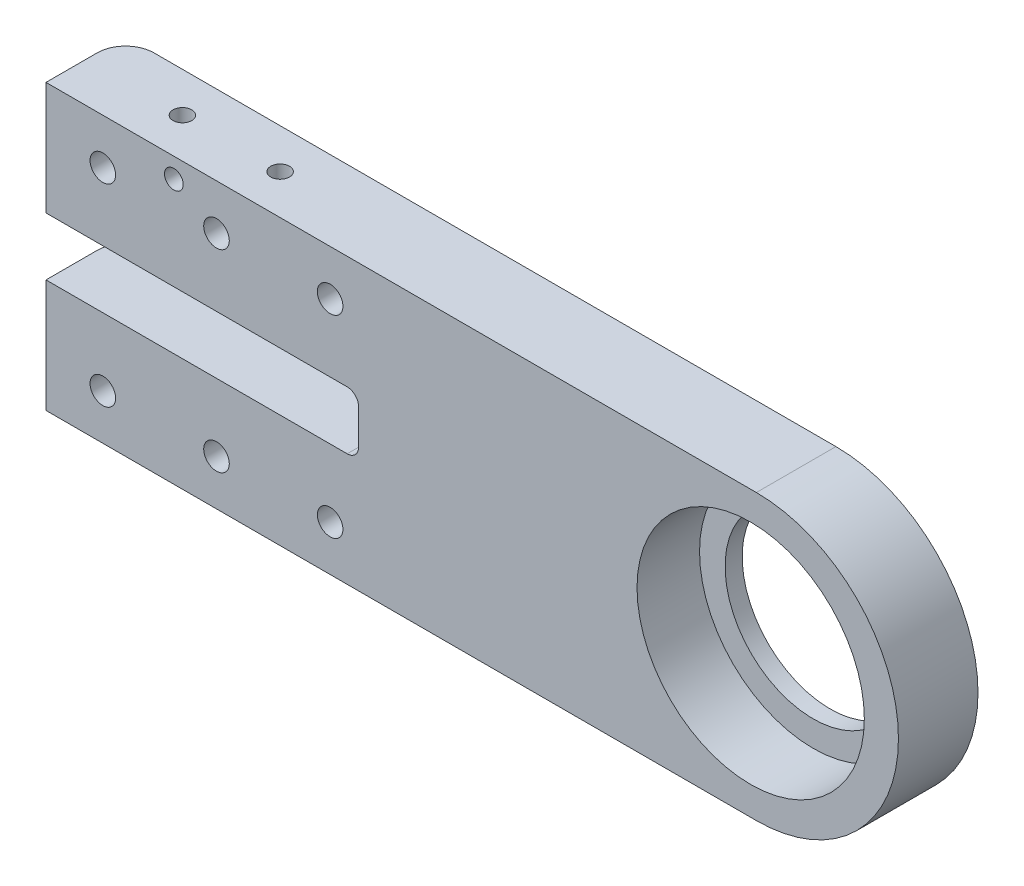
ISO-10303-21;
HEADER;
FILE_DESCRIPTION(('STEP AP214'),'2;1');
FILE_NAME('part.step','',(''),(''),'','','');
FILE_SCHEMA(('AUTOMOTIVE_DESIGN { 1 0 10303 214 1 1 1 1 }'));
ENDSEC;
DATA;
#1=APPLICATION_CONTEXT('core data for automotive mechanical design processes');
#2=APPLICATION_PROTOCOL_DEFINITION('international standard','automotive_design',2000,#1);
#3=PRODUCT_CONTEXT('',#1,'mechanical');
#4=PRODUCT('Part','Part','',(#3));
#5=PRODUCT_RELATED_PRODUCT_CATEGORY('part','',(#4));
#6=PRODUCT_DEFINITION_FORMATION('','',#4);
#7=PRODUCT_DEFINITION_CONTEXT('part definition',#1,'design');
#8=PRODUCT_DEFINITION('design','',#6,#7);
#9=PRODUCT_DEFINITION_SHAPE('','',#8);
#10=(LENGTH_UNIT() NAMED_UNIT(*) SI_UNIT(.MILLI.,.METRE.));
#11=(NAMED_UNIT(*) PLANE_ANGLE_UNIT() SI_UNIT($,.RADIAN.));
#12=(NAMED_UNIT(*) SI_UNIT($,.STERADIAN.) SOLID_ANGLE_UNIT());
#13=UNCERTAINTY_MEASURE_WITH_UNIT(LENGTH_MEASURE(1.E-05),#10,'distance_accuracy_value','');
#14=(GEOMETRIC_REPRESENTATION_CONTEXT(3) GLOBAL_UNCERTAINTY_ASSIGNED_CONTEXT((#13)) GLOBAL_UNIT_ASSIGNED_CONTEXT((#10,
#11,#12)) REPRESENTATION_CONTEXT('',''));
#15=CARTESIAN_POINT('',(0.,0.,0.));
#16=DIRECTION('',(0.,0.,1.));
#17=DIRECTION('',(1.,0.,0.));
#18=AXIS2_PLACEMENT_3D('',#15,#16,#17);
#19=CARTESIAN_POINT('',(0.,-50.,14.));
#20=DIRECTION('',(-1.,0.,0.));
#21=DIRECTION('',(0.,-1.,0.));
#22=AXIS2_PLACEMENT_3D('',#19,#20,#21);
#23=PLANE('',#22);
#24=DIRECTION('',(0.,0.,-1.));
#25=VECTOR('',#24,1.);
#26=CARTESIAN_POINT('',(0.,0.,14.));
#27=LINE('',#26,#25);
#28=CARTESIAN_POINT('',(0.,0.,14.));
#29=VERTEX_POINT('',#28);
#30=CARTESIAN_POINT('',(0.,0.,5.));
#31=VERTEX_POINT('',#30);
#32=EDGE_CURVE('E175',#29,#31,#27,.T.);
#33=ORIENTED_EDGE('',*,*,#32,.T.);
#34=DIRECTION('',(0.,1.,0.));
#35=VECTOR('',#34,1.);
#36=CARTESIAN_POINT('',(0.,-50.,5.));
#37=LINE('',#36,#35);
#38=CARTESIAN_POINT('',(0.,-19.8999999994651,5.));
#39=VERTEX_POINT('',#38);
#40=EDGE_CURVE('E43',#31,#39,#37,.F.);
#41=ORIENTED_EDGE('',*,*,#40,.T.);
#42=DIRECTION('',(0.,0.,1.));
#43=VECTOR('',#42,1.);
#44=CARTESIAN_POINT('',(0.,-19.8999999994651,0.));
#45=LINE('',#44,#43);
#46=CARTESIAN_POINT('',(0.,-19.8999999994651,14.));
#47=VERTEX_POINT('',#46);
#48=EDGE_CURVE('E134',#39,#47,#45,.T.);
#49=ORIENTED_EDGE('',*,*,#48,.T.);
#50=DIRECTION('',(0.,1.,0.));
#51=VECTOR('',#50,1.);
#52=CARTESIAN_POINT('',(0.,-50.,14.));
#53=LINE('',#52,#51);
#54=EDGE_CURVE('E153',#47,#29,#53,.T.);
#55=ORIENTED_EDGE('',*,*,#54,.T.);
#56=EDGE_LOOP('',(#33,#41,#49,#55));
#57=FACE_BOUND('',#56,.T.);
#58=ADVANCED_FACE('F35',(#57),#23,.T.);
#59=CARTESIAN_POINT('',(125.,-25.,14.));
#60=DIRECTION('',(0.,0.,-1.));
#61=DIRECTION('',(-1.,0.,0.));
#62=AXIS2_PLACEMENT_3D('',#59,#60,#61);
#63=CYLINDRICAL_SURFACE('',#62,25.);
#64=CARTESIAN_POINT('',(125.,-25.,0.));
#65=DIRECTION('',(0.,0.,-1.));
#66=DIRECTION('',(-1.,0.,0.));
#67=AXIS2_PLACEMENT_3D('',#64,#65,#66);
#68=CIRCLE('',#67,25.);
#69=CARTESIAN_POINT('',(125.,0.,0.));
#70=VERTEX_POINT('',#69);
#71=CARTESIAN_POINT('',(125.,-50.,0.));
#72=VERTEX_POINT('',#71);
#73=EDGE_CURVE('E162',#70,#72,#68,.T.);
#74=ORIENTED_EDGE('',*,*,#73,.F.);
#75=DIRECTION('',(0.,0.,-1.));
#76=VECTOR('',#75,1.);
#77=CARTESIAN_POINT('',(125.,0.,14.));
#78=LINE('',#77,#76);
#79=CARTESIAN_POINT('',(125.,0.,14.));
#80=VERTEX_POINT('',#79);
#81=EDGE_CURVE('E171',#80,#70,#78,.T.);
#82=ORIENTED_EDGE('',*,*,#81,.F.);
#83=CARTESIAN_POINT('',(125.,-25.,14.));
#84=DIRECTION('',(0.,0.,-1.));
#85=DIRECTION('',(-1.,0.,0.));
#86=AXIS2_PLACEMENT_3D('',#83,#84,#85);
#87=CIRCLE('',#86,25.);
#88=CARTESIAN_POINT('',(125.,-50.,14.));
#89=VERTEX_POINT('',#88);
#90=EDGE_CURVE('E170',#80,#89,#87,.T.);
#91=ORIENTED_EDGE('',*,*,#90,.T.);
#92=DIRECTION('',(0.,0.,-1.));
#93=VECTOR('',#92,1.);
#94=CARTESIAN_POINT('',(125.,-50.,14.));
#95=LINE('',#94,#93);
#96=EDGE_CURVE('E156',#89,#72,#95,.T.);
#97=ORIENTED_EDGE('',*,*,#96,.T.);
#98=EDGE_LOOP('',(#74,#82,#91,#97));
#99=FACE_BOUND('',#98,.T.);
#100=ADVANCED_FACE('F263',(#99),#63,.T.);
#101=CARTESIAN_POINT('',(0.,0.,14.));
#102=DIRECTION('',(0.,1.,0.));
#103=DIRECTION('',(0.,0.,1.));
#104=AXIS2_PLACEMENT_3D('',#101,#102,#103);
#105=PLANE('',#104);
#106=CARTESIAN_POINT('',(17.,0.,7.00000000000001));
#107=DIRECTION('',(0.,1.,0.));
#108=DIRECTION('',(0.,0.,1.));
#109=AXIS2_PLACEMENT_3D('',#106,#107,#108);
#110=CIRCLE('',#109,1.64999999999998);
#111=CARTESIAN_POINT('',(17.,0.,8.64999999999999));
#112=VERTEX_POINT('',#111);
#113=EDGE_CURVE('E370',#112,#112,#110,.T.);
#114=ORIENTED_EDGE('',*,*,#113,.F.);
#115=EDGE_LOOP('',(#114));
#116=FACE_BOUND('',#115,.T.);
#117=CARTESIAN_POINT('',(34.2,0.,7.00000000000001));
#118=DIRECTION('',(0.,1.,0.));
#119=DIRECTION('',(0.,0.,1.));
#120=AXIS2_PLACEMENT_3D('',#117,#118,#119);
#121=CIRCLE('',#120,1.64999999999998);
#122=CARTESIAN_POINT('',(34.2,0.,8.64999999999999));
#123=VERTEX_POINT('',#122);
#124=EDGE_CURVE('E376',#123,#123,#121,.T.);
#125=ORIENTED_EDGE('',*,*,#124,.F.);
#126=EDGE_LOOP('',(#125));
#127=FACE_BOUND('',#126,.T.);
#128=DIRECTION('',(1.,0.,0.));
#129=VECTOR('',#128,1.);
#130=CARTESIAN_POINT('',(0.,0.,0.));
#131=LINE('',#130,#129);
#132=CARTESIAN_POINT('',(5.,0.,0.));
#133=VERTEX_POINT('',#132);
#134=EDGE_CURVE('E168',#133,#70,#131,.T.);
#135=ORIENTED_EDGE('',*,*,#134,.F.);
#136=CARTESIAN_POINT('',(5.,0.,5.));
#137=DIRECTION('',(0.,1.,0.));
#138=DIRECTION('',(0.,0.,1.));
#139=AXIS2_PLACEMENT_3D('',#136,#137,#138);
#140=CIRCLE('',#139,5.);
#141=EDGE_CURVE('E57',#133,#31,#140,.T.);
#142=ORIENTED_EDGE('',*,*,#141,.T.);
#143=ORIENTED_EDGE('',*,*,#32,.F.);
#144=DIRECTION('',(1.,0.,0.));
#145=VECTOR('',#144,1.);
#146=CARTESIAN_POINT('',(0.,0.,14.));
#147=LINE('',#146,#145);
#148=EDGE_CURVE('E152',#29,#80,#147,.T.);
#149=ORIENTED_EDGE('',*,*,#148,.T.);
#150=ORIENTED_EDGE('',*,*,#81,.T.);
#151=EDGE_LOOP('',(#135,#142,#143,#149,#150));
#152=FACE_BOUND('',#151,.T.);
#153=ADVANCED_FACE('F268',(#116,#127,#152),#105,.T.);
#154=DIRECTION('',(0.,0.,1.));
#155=VECTOR('',#154,1.);
#156=CARTESIAN_POINT('',(0.,-30.0999999994651,0.));
#157=LINE('',#156,#155);
#158=CARTESIAN_POINT('',(0.,-30.0999999994651,5.));
#159=VERTEX_POINT('',#158);
#160=CARTESIAN_POINT('',(0.,-30.0999999994651,14.));
#161=VERTEX_POINT('',#160);
#162=EDGE_CURVE('E123',#159,#161,#157,.T.);
#163=ORIENTED_EDGE('',*,*,#162,.F.);
#164=DIRECTION('',(0.,1.,0.));
#165=VECTOR('',#164,1.);
#166=CARTESIAN_POINT('',(0.,-50.,5.));
#167=LINE('',#166,#165);
#168=CARTESIAN_POINT('',(0.,-50.,5.));
#169=VERTEX_POINT('',#168);
#170=EDGE_CURVE('E238',#159,#169,#167,.F.);
#171=ORIENTED_EDGE('',*,*,#170,.T.);
#172=DIRECTION('',(0.,0.,-1.));
#173=VECTOR('',#172,1.);
#174=CARTESIAN_POINT('',(0.,-50.,14.));
#175=LINE('',#174,#173);
#176=CARTESIAN_POINT('',(0.,-50.,14.));
#177=VERTEX_POINT('',#176);
#178=EDGE_CURVE('E151',#177,#169,#175,.T.);
#179=ORIENTED_EDGE('',*,*,#178,.F.);
#180=EDGE_CURVE('E142',#177,#161,#53,.T.);
#181=ORIENTED_EDGE('',*,*,#180,.T.);
#182=EDGE_LOOP('',(#163,#171,#179,#181));
#183=FACE_BOUND('',#182,.T.);
#184=ADVANCED_FACE('F149',(#183),#23,.T.);
#185=CARTESIAN_POINT('',(125.,-50.,14.));
#186=DIRECTION('',(0.,-1.,0.));
#187=DIRECTION('',(0.,0.,-1.));
#188=AXIS2_PLACEMENT_3D('',#185,#186,#187);
#189=PLANE('',#188);
#190=ORIENTED_EDGE('',*,*,#178,.T.);
#191=CARTESIAN_POINT('',(5.00000000000001,-50.,5.));
#192=DIRECTION('',(0.,-1.,0.));
#193=DIRECTION('',(0.,0.,-1.));
#194=AXIS2_PLACEMENT_3D('',#191,#192,#193);
#195=CIRCLE('',#194,5.);
#196=CARTESIAN_POINT('',(5.,-50.,0.));
#197=VERTEX_POINT('',#196);
#198=EDGE_CURVE('E240',#169,#197,#195,.T.);
#199=ORIENTED_EDGE('',*,*,#198,.T.);
#200=DIRECTION('',(-1.,0.,0.));
#201=VECTOR('',#200,1.);
#202=CARTESIAN_POINT('',(125.,-50.,0.));
#203=LINE('',#202,#201);
#204=EDGE_CURVE('E165',#72,#197,#203,.T.);
#205=ORIENTED_EDGE('',*,*,#204,.F.);
#206=ORIENTED_EDGE('',*,*,#96,.F.);
#207=DIRECTION('',(-1.,0.,0.));
#208=VECTOR('',#207,1.);
#209=CARTESIAN_POINT('',(125.,-50.,14.));
#210=LINE('',#209,#208);
#211=EDGE_CURVE('E158',#89,#177,#210,.T.);
#212=ORIENTED_EDGE('',*,*,#211,.T.);
#213=EDGE_LOOP('',(#190,#199,#205,#206,#212));
#214=FACE_BOUND('',#213,.T.);
#215=ADVANCED_FACE('F245',(#214),#189,.T.);
#216=CARTESIAN_POINT('',(125.,-25.,14.));
#217=DIRECTION('',(0.,0.,-1.));
#218=DIRECTION('',(-1.,0.,0.));
#219=AXIS2_PLACEMENT_3D('',#216,#217,#218);
#220=PLANE('',#219);
#221=CARTESIAN_POINT('',(123.999999994871,-24.9999999994651,14.));
#222=DIRECTION('',(0.,0.,1.));
#223=DIRECTION('',(1.,0.,0.));
#224=AXIS2_PLACEMENT_3D('',#221,#222,#223);
#225=CIRCLE('',#224,20.0000000051291);
#226=CARTESIAN_POINT('',(144.,-24.9999999994651,14.));
#227=VERTEX_POINT('',#226);
#228=EDGE_CURVE('E360',#227,#227,#225,.T.);
#229=ORIENTED_EDGE('',*,*,#228,.F.);
#230=EDGE_LOOP('',(#229));
#231=FACE_BOUND('',#230,.T.);
#232=CARTESIAN_POINT('',(22.5,-3.5,14.));
#233=DIRECTION('',(0.,0.,1.));
#234=DIRECTION('',(1.,0.,0.));
#235=AXIS2_PLACEMENT_3D('',#232,#233,#234);
#236=CIRCLE('',#235,1.64999999999998);
#237=CARTESIAN_POINT('',(24.15,-3.5,14.));
#238=VERTEX_POINT('',#237);
#239=EDGE_CURVE('E382',#238,#238,#236,.T.);
#240=ORIENTED_EDGE('',*,*,#239,.F.);
#241=EDGE_LOOP('',(#240));
#242=FACE_BOUND('',#241,.T.);
#243=CARTESIAN_POINT('',(10.,-8.,14.));
#244=DIRECTION('',(0.,0.,-1.));
#245=DIRECTION('',(-1.,0.,0.));
#246=AXIS2_PLACEMENT_3D('',#243,#244,#245);
#247=CIRCLE('',#246,2.24999999999997);
#248=CARTESIAN_POINT('',(7.75000000000003,-8.,14.));
#249=VERTEX_POINT('',#248);
#250=EDGE_CURVE('E388',#249,#249,#247,.T.);
#251=ORIENTED_EDGE('',*,*,#250,.T.);
#252=EDGE_LOOP('',(#251));
#253=FACE_BOUND('',#252,.T.);
#254=CARTESIAN_POINT('',(9.99999999999998,-42.,14.));
#255=DIRECTION('',(0.,0.,-1.));
#256=DIRECTION('',(-1.,0.,0.));
#257=AXIS2_PLACEMENT_3D('',#254,#255,#256);
#258=CIRCLE('',#257,2.24999999999997);
#259=CARTESIAN_POINT('',(7.75000000000002,-42.,14.));
#260=VERTEX_POINT('',#259);
#261=EDGE_CURVE('E391',#260,#260,#258,.T.);
#262=ORIENTED_EDGE('',*,*,#261,.T.);
#263=EDGE_LOOP('',(#262));
#264=FACE_BOUND('',#263,.T.);
#265=CARTESIAN_POINT('',(30.,-42.,14.));
#266=DIRECTION('',(0.,0.,-1.));
#267=DIRECTION('',(-1.,0.,0.));
#268=AXIS2_PLACEMENT_3D('',#265,#266,#267);
#269=CIRCLE('',#268,2.24999999999997);
#270=CARTESIAN_POINT('',(27.75,-42.,14.));
#271=VERTEX_POINT('',#270);
#272=EDGE_CURVE('E394',#271,#271,#269,.T.);
#273=ORIENTED_EDGE('',*,*,#272,.T.);
#274=EDGE_LOOP('',(#273));
#275=FACE_BOUND('',#274,.T.);
#276=CARTESIAN_POINT('',(30.,-8.,14.));
#277=DIRECTION('',(0.,0.,-1.));
#278=DIRECTION('',(-1.,0.,0.));
#279=AXIS2_PLACEMENT_3D('',#276,#277,#278);
#280=CIRCLE('',#279,2.24999999999996);
#281=CARTESIAN_POINT('',(27.75,-8.,14.));
#282=VERTEX_POINT('',#281);
#283=EDGE_CURVE('E397',#282,#282,#280,.T.);
#284=ORIENTED_EDGE('',*,*,#283,.T.);
#285=EDGE_LOOP('',(#284));
#286=FACE_BOUND('',#285,.T.);
#287=CARTESIAN_POINT('',(50.,-8.00000000000001,14.));
#288=DIRECTION('',(0.,0.,-1.));
#289=DIRECTION('',(-1.,0.,0.));
#290=AXIS2_PLACEMENT_3D('',#287,#288,#289);
#291=CIRCLE('',#290,2.24999999999997);
#292=CARTESIAN_POINT('',(47.75,-8.00000000000001,14.));
#293=VERTEX_POINT('',#292);
#294=EDGE_CURVE('E400',#293,#293,#291,.T.);
#295=ORIENTED_EDGE('',*,*,#294,.T.);
#296=EDGE_LOOP('',(#295));
#297=FACE_BOUND('',#296,.T.);
#298=CARTESIAN_POINT('',(50.,-42.,14.));
#299=DIRECTION('',(0.,0.,-1.));
#300=DIRECTION('',(-1.,0.,0.));
#301=AXIS2_PLACEMENT_3D('',#298,#299,#300);
#302=CIRCLE('',#301,2.24999999999997);
#303=CARTESIAN_POINT('',(47.75,-42.,14.));
#304=VERTEX_POINT('',#303);
#305=EDGE_CURVE('E147',#304,#304,#302,.T.);
#306=ORIENTED_EDGE('',*,*,#305,.T.);
#307=EDGE_LOOP('',(#306));
#308=FACE_BOUND('',#307,.T.);
#309=ORIENTED_EDGE('',*,*,#54,.F.);
#310=DIRECTION('',(-1.,0.,0.));
#311=VECTOR('',#310,1.);
#312=CARTESIAN_POINT('',(55.,-19.8999999994651,14.));
#313=LINE('',#312,#311);
#314=CARTESIAN_POINT('',(53.,-19.8999999994651,14.));
#315=VERTEX_POINT('',#314);
#316=EDGE_CURVE('E408',#315,#47,#313,.T.);
#317=ORIENTED_EDGE('',*,*,#316,.F.);
#318=CARTESIAN_POINT('',(53.,-21.8999999994651,14.));
#319=DIRECTION('',(0.,0.,-1.));
#320=DIRECTION('',(-1.,0.,0.));
#321=AXIS2_PLACEMENT_3D('',#318,#319,#320);
#322=CIRCLE('',#321,2.);
#323=CARTESIAN_POINT('',(55.,-21.8999999994651,14.));
#324=VERTEX_POINT('',#323);
#325=EDGE_CURVE('E224',#315,#324,#322,.T.);
#326=ORIENTED_EDGE('',*,*,#325,.T.);
#327=DIRECTION('',(0.,1.,0.));
#328=VECTOR('',#327,1.);
#329=CARTESIAN_POINT('',(55.,-30.0999999994651,14.));
#330=LINE('',#329,#328);
#331=CARTESIAN_POINT('',(55.,-28.0999999994651,14.));
#332=VERTEX_POINT('',#331);
#333=EDGE_CURVE('E146',#332,#324,#330,.T.);
#334=ORIENTED_EDGE('',*,*,#333,.F.);
#335=CARTESIAN_POINT('',(53.,-28.0999999994651,14.));
#336=DIRECTION('',(0.,0.,-1.));
#337=DIRECTION('',(-1.,0.,0.));
#338=AXIS2_PLACEMENT_3D('',#335,#336,#337);
#339=CIRCLE('',#338,2.);
#340=CARTESIAN_POINT('',(53.,-30.0999999994651,14.));
#341=VERTEX_POINT('',#340);
#342=EDGE_CURVE('E145',#332,#341,#339,.T.);
#343=ORIENTED_EDGE('',*,*,#342,.T.);
#344=DIRECTION('',(1.,0.,0.));
#345=VECTOR('',#344,1.);
#346=CARTESIAN_POINT('',(0.,-30.0999999994651,14.));
#347=LINE('',#346,#345);
#348=EDGE_CURVE('E128',#161,#341,#347,.T.);
#349=ORIENTED_EDGE('',*,*,#348,.F.);
#350=ORIENTED_EDGE('',*,*,#180,.F.);
#351=ORIENTED_EDGE('',*,*,#211,.F.);
#352=ORIENTED_EDGE('',*,*,#90,.F.);
#353=ORIENTED_EDGE('',*,*,#148,.F.);
#354=EDGE_LOOP('',(#309,#317,#326,#334,#343,#349,#350,#351,#352,#353));
#355=FACE_BOUND('',#354,.T.);
#356=ADVANCED_FACE('F140',(#231,#242,#253,#264,#275,#286,#297,#308,#355),#220,.F.);
#357=CARTESIAN_POINT('',(125.,-25.,0.));
#358=DIRECTION('',(0.,0.,-1.));
#359=DIRECTION('',(-1.,0.,0.));
#360=AXIS2_PLACEMENT_3D('',#357,#358,#359);
#361=PLANE('',#360);
#362=CARTESIAN_POINT('',(30.,-42.,0.));
#363=DIRECTION('',(0.,0.,-1.));
#364=DIRECTION('',(-1.,0.,0.));
#365=AXIS2_PLACEMENT_3D('',#362,#363,#364);
#366=CIRCLE('',#365,4.70000000001612);
#367=CARTESIAN_POINT('',(25.2999999999839,-42.,0.));
#368=VERTEX_POINT('',#367);
#369=EDGE_CURVE('E196',#368,#368,#366,.F.);
#370=ORIENTED_EDGE('',*,*,#369,.T.);
#371=EDGE_LOOP('',(#370));
#372=FACE_BOUND('',#371,.T.);
#373=CARTESIAN_POINT('',(9.99999999999998,-42.,0.));
#374=DIRECTION('',(0.,0.,-1.));
#375=DIRECTION('',(-1.,0.,0.));
#376=AXIS2_PLACEMENT_3D('',#373,#374,#375);
#377=CIRCLE('',#376,4.70000000001608);
#378=CARTESIAN_POINT('',(5.2999999999839,-42.,0.));
#379=VERTEX_POINT('',#378);
#380=EDGE_CURVE('E193',#379,#379,#377,.F.);
#381=ORIENTED_EDGE('',*,*,#380,.T.);
#382=EDGE_LOOP('',(#381));
#383=FACE_BOUND('',#382,.T.);
#384=CARTESIAN_POINT('',(50.,-42.,0.));
#385=DIRECTION('',(0.,0.,-1.));
#386=DIRECTION('',(-1.,0.,0.));
#387=AXIS2_PLACEMENT_3D('',#384,#385,#386);
#388=CIRCLE('',#387,4.70000000001608);
#389=CARTESIAN_POINT('',(45.2999999999839,-42.,0.));
#390=VERTEX_POINT('',#389);
#391=EDGE_CURVE('E190',#390,#390,#388,.F.);
#392=ORIENTED_EDGE('',*,*,#391,.T.);
#393=EDGE_LOOP('',(#392));
#394=FACE_BOUND('',#393,.T.);
#395=CARTESIAN_POINT('',(30.,-8.,0.));
#396=DIRECTION('',(0.,0.,-1.));
#397=DIRECTION('',(-1.,0.,0.));
#398=AXIS2_PLACEMENT_3D('',#395,#396,#397);
#399=CIRCLE('',#398,4.70000000001607);
#400=CARTESIAN_POINT('',(25.2999999999839,-8.,0.));
#401=VERTEX_POINT('',#400);
#402=EDGE_CURVE('E187',#401,#401,#399,.F.);
#403=ORIENTED_EDGE('',*,*,#402,.T.);
#404=EDGE_LOOP('',(#403));
#405=FACE_BOUND('',#404,.T.);
#406=CARTESIAN_POINT('',(10.,-8.,0.));
#407=DIRECTION('',(0.,0.,-1.));
#408=DIRECTION('',(-1.,0.,0.));
#409=AXIS2_PLACEMENT_3D('',#406,#407,#408);
#410=CIRCLE('',#409,4.70000000001612);
#411=CARTESIAN_POINT('',(5.29999999998388,-8.,0.));
#412=VERTEX_POINT('',#411);
#413=EDGE_CURVE('E184',#412,#412,#410,.F.);
#414=ORIENTED_EDGE('',*,*,#413,.T.);
#415=EDGE_LOOP('',(#414));
#416=FACE_BOUND('',#415,.T.);
#417=CARTESIAN_POINT('',(50.,-8.00000000000001,0.));
#418=DIRECTION('',(0.,0.,-1.));
#419=DIRECTION('',(-1.,0.,0.));
#420=AXIS2_PLACEMENT_3D('',#417,#418,#419);
#421=CIRCLE('',#420,4.70000000001608);
#422=CARTESIAN_POINT('',(45.2999999999839,-8.00000000000001,0.));
#423=VERTEX_POINT('',#422);
#424=EDGE_CURVE('E181',#423,#423,#421,.F.);
#425=ORIENTED_EDGE('',*,*,#424,.T.);
#426=EDGE_LOOP('',(#425));
#427=FACE_BOUND('',#426,.T.);
#428=CARTESIAN_POINT('',(123.999999994871,-24.9999999994651,0.));
#429=DIRECTION('',(0.,0.,1.));
#430=DIRECTION('',(1.,0.,0.));
#431=AXIS2_PLACEMENT_3D('',#428,#429,#430);
#432=CIRCLE('',#431,15.500000004746);
#433=CARTESIAN_POINT('',(139.499999999617,-24.9999999994651,0.));
#434=VERTEX_POINT('',#433);
#435=EDGE_CURVE('E367',#434,#434,#432,.T.);
#436=ORIENTED_EDGE('',*,*,#435,.T.);
#437=EDGE_LOOP('',(#436));
#438=FACE_BOUND('',#437,.T.);
#439=CARTESIAN_POINT('',(22.5,-3.5,0.));
#440=DIRECTION('',(0.,0.,1.));
#441=DIRECTION('',(1.,0.,0.));
#442=AXIS2_PLACEMENT_3D('',#439,#440,#441);
#443=CIRCLE('',#442,1.64999999999998);
#444=CARTESIAN_POINT('',(24.15,-3.5,0.));
#445=VERTEX_POINT('',#444);
#446=EDGE_CURVE('E385',#445,#445,#443,.T.);
#447=ORIENTED_EDGE('',*,*,#446,.T.);
#448=EDGE_LOOP('',(#447));
#449=FACE_BOUND('',#448,.T.);
#450=ORIENTED_EDGE('',*,*,#204,.T.);
#451=DIRECTION('',(0.,1.,0.));
#452=VECTOR('',#451,1.);
#453=CARTESIAN_POINT('',(5.,-25.,0.));
#454=LINE('',#453,#452);
#455=CARTESIAN_POINT('',(5.,-30.0999999994651,0.));
#456=VERTEX_POINT('',#455);
#457=EDGE_CURVE('E234',#197,#456,#454,.T.);
#458=ORIENTED_EDGE('',*,*,#457,.T.);
#459=DIRECTION('',(1.,0.,0.));
#460=VECTOR('',#459,1.);
#461=CARTESIAN_POINT('',(0.,-30.0999999994651,0.));
#462=LINE('',#461,#460);
#463=CARTESIAN_POINT('',(53.,-30.0999999994651,0.));
#464=VERTEX_POINT('',#463);
#465=EDGE_CURVE('E405',#456,#464,#462,.T.);
#466=ORIENTED_EDGE('',*,*,#465,.T.);
#467=CARTESIAN_POINT('',(53.,-28.0999999994651,0.));
#468=DIRECTION('',(0.,0.,-1.));
#469=DIRECTION('',(-1.,0.,0.));
#470=AXIS2_PLACEMENT_3D('',#467,#468,#469);
#471=CIRCLE('',#470,2.);
#472=CARTESIAN_POINT('',(55.,-28.0999999994651,0.));
#473=VERTEX_POINT('',#472);
#474=EDGE_CURVE('E229',#464,#473,#471,.F.);
#475=ORIENTED_EDGE('',*,*,#474,.T.);
#476=DIRECTION('',(0.,1.,0.));
#477=VECTOR('',#476,1.);
#478=CARTESIAN_POINT('',(55.,-30.0999999994651,0.));
#479=LINE('',#478,#477);
#480=CARTESIAN_POINT('',(55.,-21.8999999994651,0.));
#481=VERTEX_POINT('',#480);
#482=EDGE_CURVE('E407',#473,#481,#479,.T.);
#483=ORIENTED_EDGE('',*,*,#482,.T.);
#484=CARTESIAN_POINT('',(53.,-21.8999999994651,0.));
#485=DIRECTION('',(0.,0.,-1.));
#486=DIRECTION('',(-1.,0.,0.));
#487=AXIS2_PLACEMENT_3D('',#484,#485,#486);
#488=CIRCLE('',#487,2.);
#489=CARTESIAN_POINT('',(53.,-19.8999999994651,0.));
#490=VERTEX_POINT('',#489);
#491=EDGE_CURVE('E226',#481,#490,#488,.F.);
#492=ORIENTED_EDGE('',*,*,#491,.T.);
#493=DIRECTION('',(-1.,0.,0.));
#494=VECTOR('',#493,1.);
#495=CARTESIAN_POINT('',(55.,-19.8999999994651,0.));
#496=LINE('',#495,#494);
#497=CARTESIAN_POINT('',(5.,-19.8999999994651,0.));
#498=VERTEX_POINT('',#497);
#499=EDGE_CURVE('E135',#490,#498,#496,.T.);
#500=ORIENTED_EDGE('',*,*,#499,.T.);
#501=DIRECTION('',(0.,1.,0.));
#502=VECTOR('',#501,1.);
#503=CARTESIAN_POINT('',(5.,-25.,0.));
#504=LINE('',#503,#502);
#505=EDGE_CURVE('E231',#498,#133,#504,.T.);
#506=ORIENTED_EDGE('',*,*,#505,.T.);
#507=ORIENTED_EDGE('',*,*,#134,.T.);
#508=ORIENTED_EDGE('',*,*,#73,.T.);
#509=EDGE_LOOP('',(#450,#458,#466,#475,#483,#492,#500,#506,#507,#508));
#510=FACE_BOUND('',#509,.T.);
#511=ADVANCED_FACE('F249',(#372,#383,#394,#405,#416,#427,#438,#449,#510),#361,.T.);
#512=CARTESIAN_POINT('',(55.,-19.8999999994651,0.));
#513=DIRECTION('',(0.,1.,0.));
#514=DIRECTION('',(-1.,0.,0.));
#515=AXIS2_PLACEMENT_3D('',#512,#513,#514);
#516=PLANE('',#515);
#517=CARTESIAN_POINT('',(17.,-19.8999999994651,7.00000000000001));
#518=DIRECTION('',(0.,1.,0.));
#519=DIRECTION('',(-1.,0.,0.));
#520=AXIS2_PLACEMENT_3D('',#517,#518,#519);
#521=CIRCLE('',#520,1.64999999999998);
#522=CARTESIAN_POINT('',(15.35,-19.8999999994651,7.00000000000001));
#523=VERTEX_POINT('',#522);
#524=EDGE_CURVE('E373',#523,#523,#521,.T.);
#525=ORIENTED_EDGE('',*,*,#524,.T.);
#526=EDGE_LOOP('',(#525));
#527=FACE_BOUND('',#526,.T.);
#528=CARTESIAN_POINT('',(34.2,-19.8999999994651,7.00000000000001));
#529=DIRECTION('',(0.,1.,0.));
#530=DIRECTION('',(-1.,0.,0.));
#531=AXIS2_PLACEMENT_3D('',#528,#529,#530);
#532=CIRCLE('',#531,1.64999999999998);
#533=CARTESIAN_POINT('',(32.55,-19.8999999994651,7.00000000000001));
#534=VERTEX_POINT('',#533);
#535=EDGE_CURVE('E379',#534,#534,#532,.T.);
#536=ORIENTED_EDGE('',*,*,#535,.T.);
#537=EDGE_LOOP('',(#536));
#538=FACE_BOUND('',#537,.T.);
#539=ORIENTED_EDGE('',*,*,#48,.F.);
#540=CARTESIAN_POINT('',(5.,-19.8999999994651,5.));
#541=DIRECTION('',(0.,1.,0.));
#542=DIRECTION('',(-1.,0.,0.));
#543=AXIS2_PLACEMENT_3D('',#540,#541,#542);
#544=CIRCLE('',#543,5.);
#545=EDGE_CURVE('E11',#39,#498,#544,.F.);
#546=ORIENTED_EDGE('',*,*,#545,.T.);
#547=ORIENTED_EDGE('',*,*,#499,.F.);
#548=DIRECTION('',(0.,0.,1.));
#549=VECTOR('',#548,1.);
#550=CARTESIAN_POINT('',(53.,-19.8999999994651,14.));
#551=LINE('',#550,#549);
#552=EDGE_CURVE('E214',#490,#315,#551,.T.);
#553=ORIENTED_EDGE('',*,*,#552,.T.);
#554=ORIENTED_EDGE('',*,*,#316,.T.);
#555=EDGE_LOOP('',(#539,#546,#547,#553,#554));
#556=FACE_BOUND('',#555,.T.);
#557=ADVANCED_FACE('F286',(#527,#538,#556),#516,.F.);
#558=CARTESIAN_POINT('',(55.,-30.0999999994651,0.));
#559=DIRECTION('',(1.,0.,0.));
#560=DIRECTION('',(0.,0.,-1.));
#561=AXIS2_PLACEMENT_3D('',#558,#559,#560);
#562=PLANE('',#561);
#563=ORIENTED_EDGE('',*,*,#333,.T.);
#564=DIRECTION('',(0.,0.,1.));
#565=VECTOR('',#564,1.);
#566=CARTESIAN_POINT('',(55.,-21.8999999994651,0.));
#567=LINE('',#566,#565);
#568=EDGE_CURVE('E220',#324,#481,#567,.F.);
#569=ORIENTED_EDGE('',*,*,#568,.T.);
#570=ORIENTED_EDGE('',*,*,#482,.F.);
#571=DIRECTION('',(0.,0.,1.));
#572=VECTOR('',#571,1.);
#573=CARTESIAN_POINT('',(55.,-28.0999999994651,14.));
#574=LINE('',#573,#572);
#575=EDGE_CURVE('E217',#473,#332,#574,.T.);
#576=ORIENTED_EDGE('',*,*,#575,.T.);
#577=EDGE_LOOP('',(#563,#569,#570,#576));
#578=FACE_BOUND('',#577,.T.);
#579=ADVANCED_FACE('F294',(#578),#562,.F.);
#580=CARTESIAN_POINT('',(0.,-30.0999999994651,0.));
#581=DIRECTION('',(0.,-1.,0.));
#582=DIRECTION('',(0.,0.,-1.));
#583=AXIS2_PLACEMENT_3D('',#580,#581,#582);
#584=PLANE('',#583);
#585=ORIENTED_EDGE('',*,*,#465,.F.);
#586=CARTESIAN_POINT('',(5.,-30.0999999994651,5.));
#587=DIRECTION('',(0.,-1.,0.));
#588=DIRECTION('',(0.,0.,-1.));
#589=AXIS2_PLACEMENT_3D('',#586,#587,#588);
#590=CIRCLE('',#589,5.);
#591=EDGE_CURVE('E130',#456,#159,#590,.F.);
#592=ORIENTED_EDGE('',*,*,#591,.T.);
#593=ORIENTED_EDGE('',*,*,#162,.T.);
#594=ORIENTED_EDGE('',*,*,#348,.T.);
#595=DIRECTION('',(0.,0.,1.));
#596=VECTOR('',#595,1.);
#597=CARTESIAN_POINT('',(53.,-30.0999999994651,0.));
#598=LINE('',#597,#596);
#599=EDGE_CURVE('E222',#341,#464,#598,.F.);
#600=ORIENTED_EDGE('',*,*,#599,.T.);
#601=EDGE_LOOP('',(#585,#592,#593,#594,#600));
#602=FACE_BOUND('',#601,.T.);
#603=ADVANCED_FACE('F126',(#602),#584,.F.);
#604=CARTESIAN_POINT('',(50.,-42.,0.));
#605=DIRECTION('',(0.,0.,-1.));
#606=DIRECTION('',(-1.,0.,0.));
#607=AXIS2_PLACEMENT_3D('',#604,#605,#606);
#608=CYLINDRICAL_SURFACE('',#607,2.24999999999997);
#609=CARTESIAN_POINT('',(50.,-42.,2.4499999999024));
#610=DIRECTION('',(0.,0.,-1.));
#611=DIRECTION('',(-1.,0.,0.));
#612=AXIS2_PLACEMENT_3D('',#609,#610,#611);
#613=CIRCLE('',#612,2.24999999999997);
#614=CARTESIAN_POINT('',(47.75,-42.,2.4499999999024));
#615=VERTEX_POINT('',#614);
#616=EDGE_CURVE('E202',#615,#615,#613,.T.);
#617=ORIENTED_EDGE('',*,*,#616,.T.);
#618=EDGE_LOOP('',(#617));
#619=FACE_BOUND('',#618,.T.);
#620=ORIENTED_EDGE('',*,*,#305,.F.);
#621=EDGE_LOOP('',(#620));
#622=FACE_BOUND('',#621,.T.);
#623=ADVANCED_FACE('F293',(#619,#622),#608,.F.);
#624=CARTESIAN_POINT('',(50.,-8.00000000000001,0.));
#625=DIRECTION('',(0.,0.,-1.));
#626=DIRECTION('',(-1.,0.,0.));
#627=AXIS2_PLACEMENT_3D('',#624,#625,#626);
#628=CYLINDRICAL_SURFACE('',#627,2.24999999999997);
#629=CARTESIAN_POINT('',(50.,-8.00000000000001,2.4499999999024));
#630=DIRECTION('',(0.,0.,-1.));
#631=DIRECTION('',(-1.,0.,0.));
#632=AXIS2_PLACEMENT_3D('',#629,#630,#631);
#633=CIRCLE('',#632,2.24999999999997);
#634=CARTESIAN_POINT('',(47.75,-8.00000000000001,2.4499999999024));
#635=VERTEX_POINT('',#634);
#636=EDGE_CURVE('E211',#635,#635,#633,.T.);
#637=ORIENTED_EDGE('',*,*,#636,.T.);
#638=EDGE_LOOP('',(#637));
#639=FACE_BOUND('',#638,.T.);
#640=ORIENTED_EDGE('',*,*,#294,.F.);
#641=EDGE_LOOP('',(#640));
#642=FACE_BOUND('',#641,.T.);
#643=ADVANCED_FACE('F303',(#639,#642),#628,.F.);
#644=CARTESIAN_POINT('',(30.,-8.,0.));
#645=DIRECTION('',(0.,0.,-1.));
#646=DIRECTION('',(-1.,0.,0.));
#647=AXIS2_PLACEMENT_3D('',#644,#645,#646);
#648=CYLINDRICAL_SURFACE('',#647,2.24999999999996);
#649=CARTESIAN_POINT('',(30.,-8.,2.44999999990241));
#650=DIRECTION('',(0.,0.,-1.));
#651=DIRECTION('',(-1.,0.,0.));
#652=AXIS2_PLACEMENT_3D('',#649,#650,#651);
#653=CIRCLE('',#652,2.24999999999996);
#654=CARTESIAN_POINT('',(27.75,-8.,2.44999999990241));
#655=VERTEX_POINT('',#654);
#656=EDGE_CURVE('E205',#655,#655,#653,.T.);
#657=ORIENTED_EDGE('',*,*,#656,.T.);
#658=EDGE_LOOP('',(#657));
#659=FACE_BOUND('',#658,.T.);
#660=ORIENTED_EDGE('',*,*,#283,.F.);
#661=EDGE_LOOP('',(#660));
#662=FACE_BOUND('',#661,.T.);
#663=ADVANCED_FACE('F307',(#659,#662),#648,.F.);
#664=CARTESIAN_POINT('',(30.,-42.,0.));
#665=DIRECTION('',(0.,0.,-1.));
#666=DIRECTION('',(-1.,0.,0.));
#667=AXIS2_PLACEMENT_3D('',#664,#665,#666);
#668=CYLINDRICAL_SURFACE('',#667,2.24999999999997);
#669=CARTESIAN_POINT('',(30.,-42.,2.44999999990245));
#670=DIRECTION('',(0.,0.,-1.));
#671=DIRECTION('',(-1.,0.,0.));
#672=AXIS2_PLACEMENT_3D('',#669,#670,#671);
#673=CIRCLE('',#672,2.24999999999997);
#674=CARTESIAN_POINT('',(27.75,-42.,2.44999999990245));
#675=VERTEX_POINT('',#674);
#676=EDGE_CURVE('E174',#675,#675,#673,.T.);
#677=ORIENTED_EDGE('',*,*,#676,.T.);
#678=EDGE_LOOP('',(#677));
#679=FACE_BOUND('',#678,.T.);
#680=ORIENTED_EDGE('',*,*,#272,.F.);
#681=EDGE_LOOP('',(#680));
#682=FACE_BOUND('',#681,.T.);
#683=ADVANCED_FACE('F311',(#679,#682),#668,.F.);
#684=CARTESIAN_POINT('',(9.99999999999998,-42.,0.));
#685=DIRECTION('',(0.,0.,-1.));
#686=DIRECTION('',(-1.,0.,0.));
#687=AXIS2_PLACEMENT_3D('',#684,#685,#686);
#688=CYLINDRICAL_SURFACE('',#687,2.24999999999997);
#689=CARTESIAN_POINT('',(9.99999999999998,-42.,2.4499999999024));
#690=DIRECTION('',(0.,0.,-1.));
#691=DIRECTION('',(-1.,0.,0.));
#692=AXIS2_PLACEMENT_3D('',#689,#690,#691);
#693=CIRCLE('',#692,2.24999999999997);
#694=CARTESIAN_POINT('',(7.75000000000002,-42.,2.4499999999024));
#695=VERTEX_POINT('',#694);
#696=EDGE_CURVE('E199',#695,#695,#693,.T.);
#697=ORIENTED_EDGE('',*,*,#696,.T.);
#698=EDGE_LOOP('',(#697));
#699=FACE_BOUND('',#698,.T.);
#700=ORIENTED_EDGE('',*,*,#261,.F.);
#701=EDGE_LOOP('',(#700));
#702=FACE_BOUND('',#701,.T.);
#703=ADVANCED_FACE('F315',(#699,#702),#688,.F.);
#704=CARTESIAN_POINT('',(10.,-8.,0.));
#705=DIRECTION('',(0.,0.,-1.));
#706=DIRECTION('',(-1.,0.,0.));
#707=AXIS2_PLACEMENT_3D('',#704,#705,#706);
#708=CYLINDRICAL_SURFACE('',#707,2.24999999999997);
#709=CARTESIAN_POINT('',(10.,-8.,2.44999999990245));
#710=DIRECTION('',(0.,0.,-1.));
#711=DIRECTION('',(-1.,0.,0.));
#712=AXIS2_PLACEMENT_3D('',#709,#710,#711);
#713=CIRCLE('',#712,2.24999999999997);
#714=CARTESIAN_POINT('',(7.75000000000003,-8.,2.44999999990245));
#715=VERTEX_POINT('',#714);
#716=EDGE_CURVE('E208',#715,#715,#713,.T.);
#717=ORIENTED_EDGE('',*,*,#716,.T.);
#718=EDGE_LOOP('',(#717));
#719=FACE_BOUND('',#718,.T.);
#720=ORIENTED_EDGE('',*,*,#250,.F.);
#721=EDGE_LOOP('',(#720));
#722=FACE_BOUND('',#721,.T.);
#723=ADVANCED_FACE('F319',(#719,#722),#708,.F.);
#724=CARTESIAN_POINT('',(22.5,-3.5,14.));
#725=DIRECTION('',(0.,0.,1.));
#726=DIRECTION('',(1.,0.,0.));
#727=AXIS2_PLACEMENT_3D('',#724,#725,#726);
#728=CYLINDRICAL_SURFACE('',#727,1.64999999999998);
#729=ORIENTED_EDGE('',*,*,#446,.F.);
#730=EDGE_LOOP('',(#729));
#731=FACE_BOUND('',#730,.T.);
#732=ORIENTED_EDGE('',*,*,#239,.T.);
#733=EDGE_LOOP('',(#732));
#734=FACE_BOUND('',#733,.T.);
#735=ADVANCED_FACE('F323',(#731,#734),#728,.F.);
#736=CARTESIAN_POINT('',(34.2,0.,7.00000000000001));
#737=DIRECTION('',(0.,1.,0.));
#738=DIRECTION('',(0.,0.,1.));
#739=AXIS2_PLACEMENT_3D('',#736,#737,#738);
#740=CYLINDRICAL_SURFACE('',#739,1.64999999999998);
#741=ORIENTED_EDGE('',*,*,#535,.F.);
#742=EDGE_LOOP('',(#741));
#743=FACE_BOUND('',#742,.T.);
#744=ORIENTED_EDGE('',*,*,#124,.T.);
#745=EDGE_LOOP('',(#744));
#746=FACE_BOUND('',#745,.T.);
#747=ADVANCED_FACE('F327',(#743,#746),#740,.F.);
#748=CARTESIAN_POINT('',(17.,0.,7.00000000000001));
#749=DIRECTION('',(0.,1.,0.));
#750=DIRECTION('',(0.,0.,1.));
#751=AXIS2_PLACEMENT_3D('',#748,#749,#750);
#752=CYLINDRICAL_SURFACE('',#751,1.64999999999998);
#753=ORIENTED_EDGE('',*,*,#524,.F.);
#754=EDGE_LOOP('',(#753));
#755=FACE_BOUND('',#754,.T.);
#756=ORIENTED_EDGE('',*,*,#113,.T.);
#757=EDGE_LOOP('',(#756));
#758=FACE_BOUND('',#757,.T.);
#759=ADVANCED_FACE('F331',(#755,#758),#752,.F.);
#760=CARTESIAN_POINT('',(123.999999994871,-24.9999999994651,14.));
#761=DIRECTION('',(0.,0.,1.));
#762=DIRECTION('',(1.,0.,0.));
#763=AXIS2_PLACEMENT_3D('',#760,#761,#762);
#764=CYLINDRICAL_SURFACE('',#763,15.500000004746);
#765=ORIENTED_EDGE('',*,*,#435,.F.);
#766=EDGE_LOOP('',(#765));
#767=FACE_BOUND('',#766,.T.);
#768=CARTESIAN_POINT('',(123.999999994871,-24.9999999994651,3.));
#769=DIRECTION('',(0.,0.,1.));
#770=DIRECTION('',(1.,0.,0.));
#771=AXIS2_PLACEMENT_3D('',#768,#769,#770);
#772=CIRCLE('',#771,15.500000004746);
#773=CARTESIAN_POINT('',(139.499999999617,-24.9999999994651,3.));
#774=VERTEX_POINT('',#773);
#775=EDGE_CURVE('E362',#774,#774,#772,.T.);
#776=ORIENTED_EDGE('',*,*,#775,.T.);
#777=EDGE_LOOP('',(#776));
#778=FACE_BOUND('',#777,.T.);
#779=ADVANCED_FACE('F335',(#767,#778),#764,.F.);
#780=CARTESIAN_POINT('',(139.499999999617,-24.9999999994651,3.));
#781=DIRECTION('',(0.,0.,-1.));
#782=DIRECTION('',(-1.,0.,0.));
#783=AXIS2_PLACEMENT_3D('',#780,#781,#782);
#784=PLANE('',#783);
#785=ORIENTED_EDGE('',*,*,#775,.F.);
#786=EDGE_LOOP('',(#785));
#787=FACE_BOUND('',#786,.T.);
#788=CARTESIAN_POINT('',(123.999999994871,-24.9999999994651,3.));
#789=DIRECTION('',(0.,0.,1.));
#790=DIRECTION('',(1.,0.,0.));
#791=AXIS2_PLACEMENT_3D('',#788,#789,#790);
#792=CIRCLE('',#791,20.0000000051291);
#793=CARTESIAN_POINT('',(144.,-24.9999999994651,3.));
#794=VERTEX_POINT('',#793);
#795=EDGE_CURVE('E357',#794,#794,#792,.T.);
#796=ORIENTED_EDGE('',*,*,#795,.T.);
#797=EDGE_LOOP('',(#796));
#798=FACE_BOUND('',#797,.T.);
#799=ADVANCED_FACE('F339',(#787,#798),#784,.F.);
#800=CARTESIAN_POINT('',(123.999999994871,-24.9999999994651,14.));
#801=DIRECTION('',(0.,0.,1.));
#802=DIRECTION('',(1.,0.,0.));
#803=AXIS2_PLACEMENT_3D('',#800,#801,#802);
#804=CYLINDRICAL_SURFACE('',#803,20.0000000051291);
#805=ORIENTED_EDGE('',*,*,#795,.F.);
#806=EDGE_LOOP('',(#805));
#807=FACE_BOUND('',#806,.T.);
#808=ORIENTED_EDGE('',*,*,#228,.T.);
#809=EDGE_LOOP('',(#808));
#810=FACE_BOUND('',#809,.T.);
#811=ADVANCED_FACE('F343',(#807,#810),#804,.F.);
#812=CARTESIAN_POINT('',(30.,-42.,2.44999999990245));
#813=DIRECTION('',(0.,0.,-1.));
#814=DIRECTION('',(-1.,0.,0.));
#815=AXIS2_PLACEMENT_3D('',#812,#813,#814);
#816=CONICAL_SURFACE('',#815,2.24999999999997,0.785398163420654);
#817=ORIENTED_EDGE('',*,*,#369,.F.);
#818=EDGE_LOOP('',(#817));
#819=FACE_BOUND('',#818,.T.);
#820=ORIENTED_EDGE('',*,*,#676,.F.);
#821=EDGE_LOOP('',(#820));
#822=FACE_BOUND('',#821,.T.);
#823=ADVANCED_FACE('F346',(#819,#822),#816,.F.);
#824=CARTESIAN_POINT('',(9.99999999999998,-42.,2.4499999999024));
#825=DIRECTION('',(0.,0.,-1.));
#826=DIRECTION('',(-1.,0.,0.));
#827=AXIS2_PLACEMENT_3D('',#824,#825,#826);
#828=CONICAL_SURFACE('',#827,2.24999999999997,0.785398163420654);
#829=ORIENTED_EDGE('',*,*,#380,.F.);
#830=EDGE_LOOP('',(#829));
#831=FACE_BOUND('',#830,.T.);
#832=ORIENTED_EDGE('',*,*,#696,.F.);
#833=EDGE_LOOP('',(#832));
#834=FACE_BOUND('',#833,.T.);
#835=ADVANCED_FACE('F351',(#831,#834),#828,.F.);
#836=CARTESIAN_POINT('',(50.,-42.,2.4499999999024));
#837=DIRECTION('',(0.,0.,-1.));
#838=DIRECTION('',(-1.,0.,0.));
#839=AXIS2_PLACEMENT_3D('',#836,#837,#838);
#840=CONICAL_SURFACE('',#839,2.24999999999997,0.785398163420654);
#841=ORIENTED_EDGE('',*,*,#391,.F.);
#842=EDGE_LOOP('',(#841));
#843=FACE_BOUND('',#842,.T.);
#844=ORIENTED_EDGE('',*,*,#616,.F.);
#845=EDGE_LOOP('',(#844));
#846=FACE_BOUND('',#845,.T.);
#847=ADVANCED_FACE('F448',(#843,#846),#840,.F.);
#848=CARTESIAN_POINT('',(30.,-8.,2.44999999990241));
#849=DIRECTION('',(0.,0.,-1.));
#850=DIRECTION('',(-1.,0.,0.));
#851=AXIS2_PLACEMENT_3D('',#848,#849,#850);
#852=CONICAL_SURFACE('',#851,2.24999999999996,0.785398163420652);
#853=ORIENTED_EDGE('',*,*,#402,.F.);
#854=EDGE_LOOP('',(#853));
#855=FACE_BOUND('',#854,.T.);
#856=ORIENTED_EDGE('',*,*,#656,.F.);
#857=EDGE_LOOP('',(#856));
#858=FACE_BOUND('',#857,.T.);
#859=ADVANCED_FACE('F444',(#855,#858),#852,.F.);
#860=CARTESIAN_POINT('',(10.,-8.,2.44999999990245));
#861=DIRECTION('',(0.,0.,-1.));
#862=DIRECTION('',(-1.,0.,0.));
#863=AXIS2_PLACEMENT_3D('',#860,#861,#862);
#864=CONICAL_SURFACE('',#863,2.24999999999997,0.785398163420654);
#865=ORIENTED_EDGE('',*,*,#413,.F.);
#866=EDGE_LOOP('',(#865));
#867=FACE_BOUND('',#866,.T.);
#868=ORIENTED_EDGE('',*,*,#716,.F.);
#869=EDGE_LOOP('',(#868));
#870=FACE_BOUND('',#869,.T.);
#871=ADVANCED_FACE('F438',(#867,#870),#864,.F.);
#872=CARTESIAN_POINT('',(50.,-8.00000000000001,2.4499999999024));
#873=DIRECTION('',(0.,0.,-1.));
#874=DIRECTION('',(-1.,0.,0.));
#875=AXIS2_PLACEMENT_3D('',#872,#873,#874);
#876=CONICAL_SURFACE('',#875,2.24999999999997,0.785398163420654);
#877=ORIENTED_EDGE('',*,*,#424,.F.);
#878=EDGE_LOOP('',(#877));
#879=FACE_BOUND('',#878,.T.);
#880=ORIENTED_EDGE('',*,*,#636,.F.);
#881=EDGE_LOOP('',(#880));
#882=FACE_BOUND('',#881,.T.);
#883=ADVANCED_FACE('F433',(#879,#882),#876,.F.);
#884=CARTESIAN_POINT('',(53.,-21.8999999994651,0.));
#885=DIRECTION('',(0.,0.,-1.));
#886=DIRECTION('',(-1.,0.,0.));
#887=AXIS2_PLACEMENT_3D('',#884,#885,#886);
#888=CYLINDRICAL_SURFACE('',#887,2.);
#889=ORIENTED_EDGE('',*,*,#491,.F.);
#890=ORIENTED_EDGE('',*,*,#568,.F.);
#891=ORIENTED_EDGE('',*,*,#325,.F.);
#892=ORIENTED_EDGE('',*,*,#552,.F.);
#893=EDGE_LOOP('',(#889,#890,#891,#892));
#894=FACE_BOUND('',#893,.T.);
#895=ADVANCED_FACE('F259',(#894),#888,.F.);
#896=CARTESIAN_POINT('',(53.,-28.0999999994651,0.));
#897=DIRECTION('',(0.,0.,-1.));
#898=DIRECTION('',(-1.,0.,0.));
#899=AXIS2_PLACEMENT_3D('',#896,#897,#898);
#900=CYLINDRICAL_SURFACE('',#899,2.);
#901=ORIENTED_EDGE('',*,*,#474,.F.);
#902=ORIENTED_EDGE('',*,*,#599,.F.);
#903=ORIENTED_EDGE('',*,*,#342,.F.);
#904=ORIENTED_EDGE('',*,*,#575,.F.);
#905=EDGE_LOOP('',(#901,#902,#903,#904));
#906=FACE_BOUND('',#905,.T.);
#907=ADVANCED_FACE('F253',(#906),#900,.F.);
#908=CARTESIAN_POINT('',(5.,-25.,5.));
#909=DIRECTION('',(0.,1.,0.));
#910=DIRECTION('',(-1.,0.,0.));
#911=AXIS2_PLACEMENT_3D('',#908,#909,#910);
#912=CYLINDRICAL_SURFACE('',#911,5.);
#913=ORIENTED_EDGE('',*,*,#198,.F.);
#914=ORIENTED_EDGE('',*,*,#170,.F.);
#915=ORIENTED_EDGE('',*,*,#591,.F.);
#916=ORIENTED_EDGE('',*,*,#457,.F.);
#917=EDGE_LOOP('',(#913,#914,#915,#916));
#918=FACE_BOUND('',#917,.T.);
#919=ADVANCED_FACE('F251',(#918),#912,.T.);
#920=CARTESIAN_POINT('',(5.,-25.,5.));
#921=DIRECTION('',(0.,1.,0.));
#922=DIRECTION('',(-1.,0.,0.));
#923=AXIS2_PLACEMENT_3D('',#920,#921,#922);
#924=CYLINDRICAL_SURFACE('',#923,5.);
#925=ORIENTED_EDGE('',*,*,#545,.F.);
#926=ORIENTED_EDGE('',*,*,#40,.F.);
#927=ORIENTED_EDGE('',*,*,#141,.F.);
#928=ORIENTED_EDGE('',*,*,#505,.F.);
#929=EDGE_LOOP('',(#925,#926,#927,#928));
#930=FACE_BOUND('',#929,.T.);
#931=ADVANCED_FACE('F37',(#930),#924,.T.);
#932=CLOSED_SHELL('',(#58,#100,#153,#184,#215,#356,#511,#557,#579,#603,#623,#643,#663,#683,#703,
#723,#735,#747,#759,#779,#799,#811,#823,#835,#847,#859,#871,#883,#895,#907,#919,#931));
#933=MANIFOLD_SOLID_BREP('B2',#932);
#934=ADVANCED_BREP_SHAPE_REPRESENTATION('',(#18,#933),#14);
#935=SHAPE_DEFINITION_REPRESENTATION(#9,#934);
ENDSEC;
END-ISO-10303-21;
